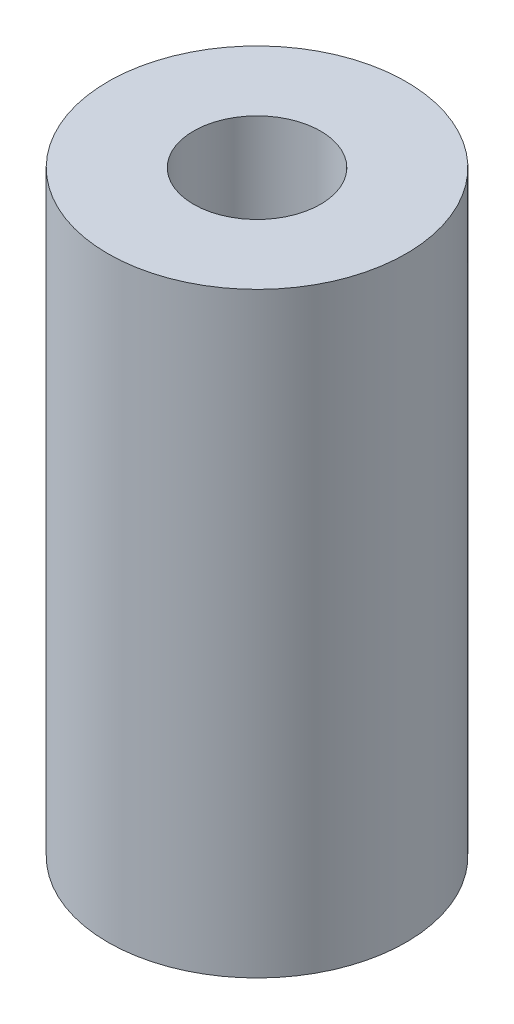
ISO-10303-21;
HEADER;
FILE_DESCRIPTION(('STEP AP214'),'2;1');
FILE_NAME('part.step','',(''),(''),'','','');
FILE_SCHEMA(('AUTOMOTIVE_DESIGN { 1 0 10303 214 1 1 1 1 }'));
ENDSEC;
DATA;
#1=APPLICATION_CONTEXT('core data for automotive mechanical design processes');
#2=APPLICATION_PROTOCOL_DEFINITION('international standard','automotive_design',2000,#1);
#3=PRODUCT_CONTEXT('',#1,'mechanical');
#4=PRODUCT('Part','Part','',(#3));
#5=PRODUCT_RELATED_PRODUCT_CATEGORY('part','',(#4));
#6=PRODUCT_DEFINITION_FORMATION('','',#4);
#7=PRODUCT_DEFINITION_CONTEXT('part definition',#1,'design');
#8=PRODUCT_DEFINITION('design','',#6,#7);
#9=PRODUCT_DEFINITION_SHAPE('','',#8);
#10=(LENGTH_UNIT() NAMED_UNIT(*) SI_UNIT(.MILLI.,.METRE.));
#11=(NAMED_UNIT(*) PLANE_ANGLE_UNIT() SI_UNIT($,.RADIAN.));
#12=(NAMED_UNIT(*) SI_UNIT($,.STERADIAN.) SOLID_ANGLE_UNIT());
#13=UNCERTAINTY_MEASURE_WITH_UNIT(LENGTH_MEASURE(1.E-05),#10,'distance_accuracy_value','');
#14=(GEOMETRIC_REPRESENTATION_CONTEXT(3) GLOBAL_UNCERTAINTY_ASSIGNED_CONTEXT((#13)) GLOBAL_UNIT_ASSIGNED_CONTEXT((#10,
#11,#12)) REPRESENTATION_CONTEXT('',''));
#15=CARTESIAN_POINT('',(0.,0.,0.));
#16=DIRECTION('',(0.,0.,1.));
#17=DIRECTION('',(1.,0.,0.));
#18=AXIS2_PLACEMENT_3D('',#15,#16,#17);
#19=CARTESIAN_POINT('',(0.,12.7,0.));
#20=DIRECTION('',(0.,-1.,0.));
#21=DIRECTION('',(0.,0.,-1.));
#22=AXIS2_PLACEMENT_3D('',#19,#20,#21);
#23=CYLINDRICAL_SURFACE('',#22,3.175);
#24=CARTESIAN_POINT('',(0.,12.7,0.));
#25=DIRECTION('',(0.,1.,0.));
#26=DIRECTION('',(0.,0.,1.));
#27=AXIS2_PLACEMENT_3D('',#24,#25,#26);
#28=CIRCLE('',#27,3.175);
#29=CARTESIAN_POINT('',(0.,12.7,3.175));
#30=VERTEX_POINT('',#29);
#31=EDGE_CURVE('E10',#30,#30,#28,.T.);
#32=ORIENTED_EDGE('',*,*,#31,.F.);
#33=EDGE_LOOP('',(#32));
#34=FACE_BOUND('',#33,.T.);
#35=CARTESIAN_POINT('',(0.,0.,0.));
#36=DIRECTION('',(0.,1.,0.));
#37=DIRECTION('',(0.,0.,1.));
#38=AXIS2_PLACEMENT_3D('',#35,#36,#37);
#39=CIRCLE('',#38,3.175);
#40=CARTESIAN_POINT('',(0.,0.,3.175));
#41=VERTEX_POINT('',#40);
#42=EDGE_CURVE('E34',#41,#41,#39,.T.);
#43=ORIENTED_EDGE('',*,*,#42,.T.);
#44=EDGE_LOOP('',(#43));
#45=FACE_BOUND('',#44,.T.);
#46=ADVANCED_FACE('F31',(#34,#45),#23,.T.);
#47=CARTESIAN_POINT('',(0.,12.7,0.));
#48=DIRECTION('',(0.,1.,0.));
#49=DIRECTION('',(0.,0.,1.));
#50=AXIS2_PLACEMENT_3D('',#47,#48,#49);
#51=PLANE('',#50);
#52=CARTESIAN_POINT('',(0.,12.7,0.));
#53=DIRECTION('',(0.,1.,0.));
#54=DIRECTION('',(0.,0.,1.));
#55=AXIS2_PLACEMENT_3D('',#52,#53,#54);
#56=CIRCLE('',#55,1.35254999999999);
#57=CARTESIAN_POINT('',(0.,12.7,1.35254999999999));
#58=VERTEX_POINT('',#57);
#59=EDGE_CURVE('E45',#58,#58,#56,.T.);
#60=ORIENTED_EDGE('',*,*,#59,.F.);
#61=EDGE_LOOP('',(#60));
#62=FACE_BOUND('',#61,.T.);
#63=ORIENTED_EDGE('',*,*,#31,.T.);
#64=EDGE_LOOP('',(#63));
#65=FACE_BOUND('',#64,.T.);
#66=ADVANCED_FACE('F51',(#62,#65),#51,.T.);
#67=CARTESIAN_POINT('',(0.,0.,0.));
#68=DIRECTION('',(0.,1.,0.));
#69=DIRECTION('',(0.,0.,1.));
#70=AXIS2_PLACEMENT_3D('',#67,#68,#69);
#71=PLANE('',#70);
#72=CARTESIAN_POINT('',(0.,0.,0.));
#73=DIRECTION('',(0.,1.,0.));
#74=DIRECTION('',(0.,0.,1.));
#75=AXIS2_PLACEMENT_3D('',#72,#73,#74);
#76=CIRCLE('',#75,1.35255);
#77=CARTESIAN_POINT('',(0.,0.,1.35255));
#78=VERTEX_POINT('',#77);
#79=EDGE_CURVE('E41',#78,#78,#76,.T.);
#80=ORIENTED_EDGE('',*,*,#79,.T.);
#81=EDGE_LOOP('',(#80));
#82=FACE_BOUND('',#81,.T.);
#83=ORIENTED_EDGE('',*,*,#42,.F.);
#84=EDGE_LOOP('',(#83));
#85=FACE_BOUND('',#84,.T.);
#86=ADVANCED_FACE('F53',(#82,#85),#71,.F.);
#87=CARTESIAN_POINT('',(0.,12.7,0.));
#88=DIRECTION('',(0.,1.,0.));
#89=DIRECTION('',(0.,0.,1.));
#90=AXIS2_PLACEMENT_3D('',#87,#88,#89);
#91=CYLINDRICAL_SURFACE('',#90,1.35254999999999);
#92=ORIENTED_EDGE('',*,*,#79,.F.);
#93=EDGE_LOOP('',(#92));
#94=FACE_BOUND('',#93,.T.);
#95=ORIENTED_EDGE('',*,*,#59,.T.);
#96=EDGE_LOOP('',(#95));
#97=FACE_BOUND('',#96,.T.);
#98=ADVANCED_FACE('F49',(#94,#97),#91,.F.);
#99=CLOSED_SHELL('',(#46,#66,#86,#98));
#100=MANIFOLD_SOLID_BREP('B2',#99);
#101=ADVANCED_BREP_SHAPE_REPRESENTATION('',(#18,#100),#14);
#102=SHAPE_DEFINITION_REPRESENTATION(#9,#101);
ENDSEC;
END-ISO-10303-21;
